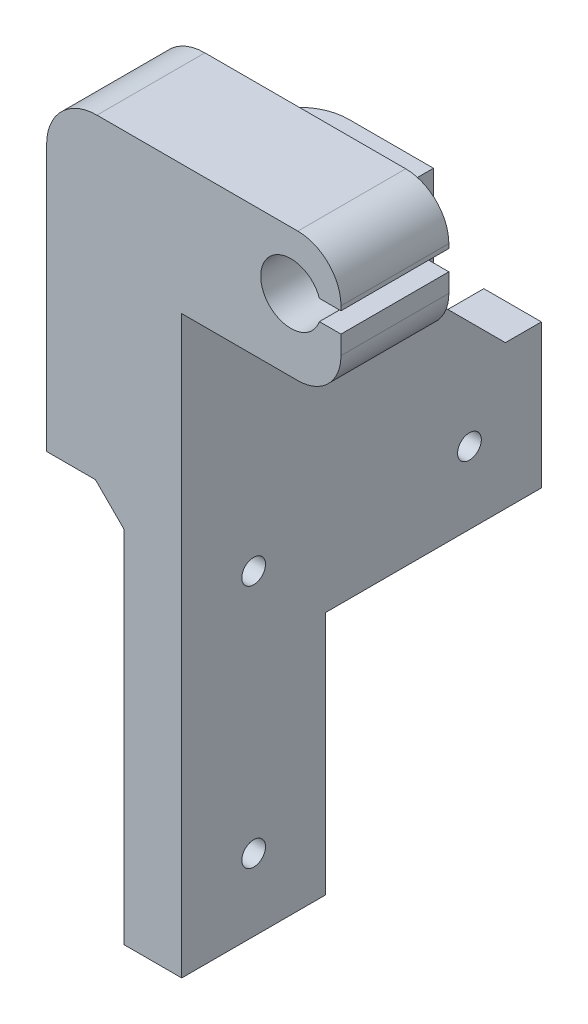
ISO-10303-21;
HEADER;
FILE_DESCRIPTION(('STEP AP214'),'2;1');
FILE_NAME('part.step','',(''),(''),'','','');
FILE_SCHEMA(('AUTOMOTIVE_DESIGN { 1 0 10303 214 1 1 1 1 }'));
ENDSEC;
DATA;
#1=APPLICATION_CONTEXT('core data for automotive mechanical design processes');
#2=APPLICATION_PROTOCOL_DEFINITION('international standard','automotive_design',2000,#1);
#3=PRODUCT_CONTEXT('',#1,'mechanical');
#4=PRODUCT('Part','Part','',(#3));
#5=PRODUCT_RELATED_PRODUCT_CATEGORY('part','',(#4));
#6=PRODUCT_DEFINITION_FORMATION('','',#4);
#7=PRODUCT_DEFINITION_CONTEXT('part definition',#1,'design');
#8=PRODUCT_DEFINITION('design','',#6,#7);
#9=PRODUCT_DEFINITION_SHAPE('','',#8);
#10=(LENGTH_UNIT() NAMED_UNIT(*) SI_UNIT(.MILLI.,.METRE.));
#11=(NAMED_UNIT(*) PLANE_ANGLE_UNIT() SI_UNIT($,.RADIAN.));
#12=(NAMED_UNIT(*) SI_UNIT($,.STERADIAN.) SOLID_ANGLE_UNIT());
#13=UNCERTAINTY_MEASURE_WITH_UNIT(LENGTH_MEASURE(1.E-05),#10,'distance_accuracy_value','');
#14=(GEOMETRIC_REPRESENTATION_CONTEXT(3) GLOBAL_UNCERTAINTY_ASSIGNED_CONTEXT((#13)) GLOBAL_UNIT_ASSIGNED_CONTEXT((#10,
#11,#12)) REPRESENTATION_CONTEXT('',''));
#15=CARTESIAN_POINT('',(0.,0.,0.));
#16=DIRECTION('',(0.,0.,1.));
#17=DIRECTION('',(1.,0.,0.));
#18=AXIS2_PLACEMENT_3D('',#15,#16,#17);
#19=CARTESIAN_POINT('',(0.,0.,15.));
#20=DIRECTION('',(1.,0.,0.));
#21=DIRECTION('',(0.,1.,0.));
#22=AXIS2_PLACEMENT_3D('',#19,#20,#21);
#23=PLANE('',#22);
#24=CARTESIAN_POINT('',(0.,-10.,-25.));
#25=DIRECTION('',(-1.,0.,0.));
#26=DIRECTION('',(0.,-1.,0.));
#27=AXIS2_PLACEMENT_3D('',#24,#25,#26);
#28=CIRCLE('',#27,1.65);
#29=CARTESIAN_POINT('',(0.,-11.65,-25.));
#30=VERTEX_POINT('',#29);
#31=EDGE_CURVE('E371',#30,#30,#28,.T.);
#32=ORIENTED_EDGE('',*,*,#31,.F.);
#33=EDGE_LOOP('',(#32));
#34=FACE_BOUND('',#33,.T.);
#35=DIRECTION('',(0.,0.,1.));
#36=VECTOR('',#35,1.);
#37=CARTESIAN_POINT('',(0.,-20.,-35.));
#38=LINE('',#37,#36);
#39=CARTESIAN_POINT('',(0.,-20.,-35.));
#40=VERTEX_POINT('',#39);
#41=CARTESIAN_POINT('',(0.,-20.,-11.0851811435686));
#42=VERTEX_POINT('',#41);
#43=EDGE_CURVE('E235',#40,#42,#38,.T.);
#44=ORIENTED_EDGE('',*,*,#43,.T.);
#45=DIRECTION('',(0.,1.,0.));
#46=VECTOR('',#45,1.);
#47=CARTESIAN_POINT('',(0.,-67.,-11.0851811435686));
#48=LINE('',#47,#46);
#49=CARTESIAN_POINT('',(0.,0.,-11.0851811435686));
#50=VERTEX_POINT('',#49);
#51=EDGE_CURVE('E213',#42,#50,#48,.T.);
#52=ORIENTED_EDGE('',*,*,#51,.T.);
#53=DIRECTION('',(0.,0.,1.));
#54=VECTOR('',#53,1.);
#55=CARTESIAN_POINT('',(0.,0.,-35.));
#56=LINE('',#55,#54);
#57=CARTESIAN_POINT('',(0.,0.,-20.));
#58=VERTEX_POINT('',#57);
#59=EDGE_CURVE('E240',#58,#50,#56,.T.);
#60=ORIENTED_EDGE('',*,*,#59,.F.);
#61=DIRECTION('',(0.,-1.,0.));
#62=VECTOR('',#61,1.);
#63=CARTESIAN_POINT('',(0.,0.,-20.));
#64=LINE('',#63,#62);
#65=CARTESIAN_POINT('',(0.,10.0000000000001,-20.));
#66=VERTEX_POINT('',#65);
#67=EDGE_CURVE('E367',#66,#58,#64,.T.);
#68=ORIENTED_EDGE('',*,*,#67,.F.);
#69=DIRECTION('',(0.,0.707106781186551,0.707106781186544));
#70=VECTOR('',#69,1.);
#71=CARTESIAN_POINT('',(0.,22.5,-7.50000000000021));
#72=LINE('',#71,#70);
#73=CARTESIAN_POINT('',(0.,0.,-30.));
#74=VERTEX_POINT('',#73);
#75=EDGE_CURVE('E386',#66,#74,#72,.F.);
#76=ORIENTED_EDGE('',*,*,#75,.T.);
#77=CARTESIAN_POINT('',(0.,0.,-35.));
#78=VERTEX_POINT('',#77);
#79=EDGE_CURVE('E236',#78,#74,#56,.T.);
#80=ORIENTED_EDGE('',*,*,#79,.F.);
#81=DIRECTION('',(0.,1.,0.));
#82=VECTOR('',#81,1.);
#83=CARTESIAN_POINT('',(0.,0.,-35.));
#84=LINE('',#83,#82);
#85=EDGE_CURVE('E457',#40,#78,#84,.T.);
#86=ORIENTED_EDGE('',*,*,#85,.F.);
#87=EDGE_LOOP('',(#44,#52,#60,#68,#76,#80,#86));
#88=FACE_BOUND('',#87,.T.);
#89=ADVANCED_FACE('F34',(#34,#88),#23,.F.);
#90=CARTESIAN_POINT('',(-10.78,0.,15.));
#91=DIRECTION('',(0.,1.,0.));
#92=DIRECTION('',(0.,0.,1.));
#93=AXIS2_PLACEMENT_3D('',#90,#91,#92);
#94=PLANE('',#93);
#95=ORIENTED_EDGE('',*,*,#59,.T.);
#96=CARTESIAN_POINT('',(1.22,0.,-10.05));
#97=DIRECTION('',(0.,1.,0.));
#98=DIRECTION('',(0.,0.,1.));
#99=AXIS2_PLACEMENT_3D('',#96,#97,#98);
#100=CIRCLE('',#99,1.6);
#101=CARTESIAN_POINT('',(0.,0.,-9.01481885643139));
#102=VERTEX_POINT('',#101);
#103=EDGE_CURVE('E469',#50,#102,#100,.T.);
#104=ORIENTED_EDGE('',*,*,#103,.T.);
#105=CARTESIAN_POINT('',(0.,0.,-5.));
#106=VERTEX_POINT('',#105);
#107=EDGE_CURVE('E228',#102,#106,#56,.T.);
#108=ORIENTED_EDGE('',*,*,#107,.T.);
#109=DIRECTION('',(1.,0.,0.));
#110=VECTOR('',#109,1.);
#111=CARTESIAN_POINT('',(8.,0.,-5.));
#112=LINE('',#111,#110);
#113=CARTESIAN_POINT('',(-3.99999999999999,0.,-5.));
#114=VERTEX_POINT('',#113);
#115=EDGE_CURVE('E260',#114,#106,#112,.T.);
#116=ORIENTED_EDGE('',*,*,#115,.F.);
#117=DIRECTION('',(0.,0.,1.));
#118=VECTOR('',#117,1.);
#119=CARTESIAN_POINT('',(-3.99999999999999,0.,15.));
#120=LINE('',#119,#118);
#121=CARTESIAN_POINT('',(-3.99999999999999,0.,15.));
#122=VERTEX_POINT('',#121);
#123=EDGE_CURVE('E286',#114,#122,#120,.T.);
#124=ORIENTED_EDGE('',*,*,#123,.T.);
#125=DIRECTION('',(1.,0.,0.));
#126=VECTOR('',#125,1.);
#127=CARTESIAN_POINT('',(-10.78,0.,15.));
#128=LINE('',#127,#126);
#129=CARTESIAN_POINT('',(-10.78,0.,15.));
#130=VERTEX_POINT('',#129);
#131=EDGE_CURVE('E309',#130,#122,#128,.T.);
#132=ORIENTED_EDGE('',*,*,#131,.F.);
#133=DIRECTION('',(0.,0.,-1.));
#134=VECTOR('',#133,1.);
#135=CARTESIAN_POINT('',(-10.78,0.,15.));
#136=LINE('',#135,#134);
#137=CARTESIAN_POINT('',(-10.78,0.,-13.));
#138=VERTEX_POINT('',#137);
#139=EDGE_CURVE('E305',#130,#138,#136,.T.);
#140=ORIENTED_EDGE('',*,*,#139,.T.);
#141=CARTESIAN_POINT('',(-3.78,0.,-13.));
#142=DIRECTION('',(0.,1.,0.));
#143=DIRECTION('',(0.,0.,1.));
#144=AXIS2_PLACEMENT_3D('',#141,#142,#143);
#145=CIRCLE('',#144,7.);
#146=CARTESIAN_POINT('',(-3.78,0.,-20.));
#147=VERTEX_POINT('',#146);
#148=EDGE_CURVE('E361',#138,#147,#145,.F.);
#149=ORIENTED_EDGE('',*,*,#148,.T.);
#150=DIRECTION('',(-1.,0.,0.));
#151=VECTOR('',#150,1.);
#152=CARTESIAN_POINT('',(-10.78,0.,-20.));
#153=LINE('',#152,#151);
#154=EDGE_CURVE('E267',#58,#147,#153,.T.);
#155=ORIENTED_EDGE('',*,*,#154,.F.);
#156=EDGE_LOOP('',(#95,#104,#108,#116,#124,#132,#140,#149,#155));
#157=FACE_BOUND('',#156,.T.);
#158=ADVANCED_FACE('F419',(#157),#94,.F.);
#159=CARTESIAN_POINT('',(0.,0.,-5.));
#160=DIRECTION('',(0.,0.,-1.));
#161=DIRECTION('',(-1.,0.,0.));
#162=AXIS2_PLACEMENT_3D('',#159,#160,#161);
#163=PLANE('',#162);
#164=DIRECTION('',(0.,1.,0.));
#165=VECTOR('',#164,1.);
#166=CARTESIAN_POINT('',(0.,0.,-5.));
#167=LINE('',#166,#165);
#168=CARTESIAN_POINT('',(0.,-54.,-5.));
#169=VERTEX_POINT('',#168);
#170=CARTESIAN_POINT('',(0.,-20.,-5.));
#171=VERTEX_POINT('',#170);
#172=EDGE_CURVE('E258',#169,#171,#167,.T.);
#173=ORIENTED_EDGE('',*,*,#172,.T.);
#174=DIRECTION('',(-1.,0.,0.));
#175=VECTOR('',#174,1.);
#176=CARTESIAN_POINT('',(8.,-20.,-5.));
#177=LINE('',#176,#175);
#178=CARTESIAN_POINT('',(8.,-20.,-5.));
#179=VERTEX_POINT('',#178);
#180=EDGE_CURVE('E234',#179,#171,#177,.T.);
#181=ORIENTED_EDGE('',*,*,#180,.F.);
#182=DIRECTION('',(0.,-1.,0.));
#183=VECTOR('',#182,1.);
#184=CARTESIAN_POINT('',(8.,0.,-5.));
#185=LINE('',#184,#183);
#186=CARTESIAN_POINT('',(8.,-54.,-5.));
#187=VERTEX_POINT('',#186);
#188=EDGE_CURVE('E253',#179,#187,#185,.T.);
#189=ORIENTED_EDGE('',*,*,#188,.T.);
#190=DIRECTION('',(-1.,0.,0.));
#191=VECTOR('',#190,1.);
#192=CARTESIAN_POINT('',(8.,-54.,-5.));
#193=LINE('',#192,#191);
#194=EDGE_CURVE('E255',#187,#169,#193,.T.);
#195=ORIENTED_EDGE('',*,*,#194,.T.);
#196=EDGE_LOOP('',(#173,#181,#189,#195));
#197=FACE_BOUND('',#196,.T.);
#198=ADVANCED_FACE('F323',(#197),#163,.T.);
#199=ORIENTED_EDGE('',*,*,#115,.T.);
#200=DIRECTION('',(0.,-1.,0.));
#201=VECTOR('',#200,1.);
#202=CARTESIAN_POINT('',(0.,0.,-5.));
#203=LINE('',#202,#201);
#204=CARTESIAN_POINT('',(0.,-4.00000000000002,-5.));
#205=VERTEX_POINT('',#204);
#206=EDGE_CURVE('E364',#106,#205,#203,.T.);
#207=ORIENTED_EDGE('',*,*,#206,.T.);
#208=DIRECTION('',(0.707106781186545,-0.70710678118655,0.));
#209=VECTOR('',#208,1.);
#210=CARTESIAN_POINT('',(0.,-4.00000000000002,-5.));
#211=LINE('',#210,#209);
#212=EDGE_CURVE('E288',#205,#114,#211,.F.);
#213=ORIENTED_EDGE('',*,*,#212,.T.);
#214=EDGE_LOOP('',(#199,#207,#213));
#215=FACE_BOUND('',#214,.T.);
#216=ADVANCED_FACE('F438',(#215),#163,.T.);
#217=CARTESIAN_POINT('',(0.,0.,0.));
#218=DIRECTION('',(0.,0.,-1.));
#219=DIRECTION('',(-1.,0.,0.));
#220=AXIS2_PLACEMENT_3D('',#217,#218,#219);
#221=PLANE('',#220);
#222=DIRECTION('',(0.,1.,0.));
#223=VECTOR('',#222,1.);
#224=CARTESIAN_POINT('',(30.14,34.6005715452371,0.));
#225=LINE('',#224,#223);
#226=CARTESIAN_POINT('',(30.14,32.,0.));
#227=VERTEX_POINT('',#226);
#228=CARTESIAN_POINT('',(30.14,34.6005715452371,0.));
#229=VERTEX_POINT('',#228);
#230=EDGE_CURVE('E477',#227,#229,#225,.T.);
#231=ORIENTED_EDGE('',*,*,#230,.F.);
#232=CARTESIAN_POINT('',(24.14,32.,0.));
#233=DIRECTION('',(0.,0.,-1.));
#234=DIRECTION('',(-1.,0.,0.));
#235=AXIS2_PLACEMENT_3D('',#232,#233,#234);
#236=CIRCLE('',#235,6.);
#237=CARTESIAN_POINT('',(24.14,26.,0.));
#238=VERTEX_POINT('',#237);
#239=EDGE_CURVE('E11',#227,#238,#236,.T.);
#240=ORIENTED_EDGE('',*,*,#239,.T.);
#241=DIRECTION('',(1.,0.,0.));
#242=VECTOR('',#241,1.);
#243=CARTESIAN_POINT('',(8.,26.,0.));
#244=LINE('',#243,#242);
#245=CARTESIAN_POINT('',(8.,26.,0.));
#246=VERTEX_POINT('',#245);
#247=EDGE_CURVE('E343',#246,#238,#244,.T.);
#248=ORIENTED_EDGE('',*,*,#247,.F.);
#249=DIRECTION('',(1.,0.,0.));
#250=VECTOR('',#249,1.);
#251=CARTESIAN_POINT('',(8.,26.,0.));
#252=LINE('',#251,#250);
#253=CARTESIAN_POINT('',(-10.78,26.,0.));
#254=VERTEX_POINT('',#253);
#255=EDGE_CURVE('E263',#254,#246,#252,.T.);
#256=ORIENTED_EDGE('',*,*,#255,.F.);
#257=DIRECTION('',(0.,-1.,0.));
#258=VECTOR('',#257,1.);
#259=CARTESIAN_POINT('',(-10.78,44.,0.));
#260=LINE('',#259,#258);
#261=CARTESIAN_POINT('',(-10.78,37.,0.));
#262=VERTEX_POINT('',#261);
#263=EDGE_CURVE('E294',#262,#254,#260,.T.);
#264=ORIENTED_EDGE('',*,*,#263,.F.);
#265=CARTESIAN_POINT('',(-3.78,37.,0.));
#266=DIRECTION('',(0.,0.,-1.));
#267=DIRECTION('',(-1.,0.,0.));
#268=AXIS2_PLACEMENT_3D('',#265,#266,#267);
#269=CIRCLE('',#268,7.);
#270=CARTESIAN_POINT('',(-3.78,44.,0.));
#271=VERTEX_POINT('',#270);
#272=EDGE_CURVE('E829',#262,#271,#269,.T.);
#273=ORIENTED_EDGE('',*,*,#272,.T.);
#274=DIRECTION('',(-1.,0.,0.));
#275=VECTOR('',#274,1.);
#276=CARTESIAN_POINT('',(27.14,44.,0.));
#277=LINE('',#276,#275);
#278=CARTESIAN_POINT('',(24.14,44.,0.));
#279=VERTEX_POINT('',#278);
#280=EDGE_CURVE('E299',#279,#271,#277,.T.);
#281=ORIENTED_EDGE('',*,*,#280,.F.);
#282=CARTESIAN_POINT('',(24.14,38.,0.));
#283=DIRECTION('',(0.,0.,-1.));
#284=DIRECTION('',(-1.,0.,0.));
#285=AXIS2_PLACEMENT_3D('',#282,#283,#284);
#286=CIRCLE('',#285,6.);
#287=CARTESIAN_POINT('',(30.14,38.,0.));
#288=VERTEX_POINT('',#287);
#289=EDGE_CURVE('E219',#279,#288,#286,.T.);
#290=ORIENTED_EDGE('',*,*,#289,.T.);
#291=DIRECTION('',(0.,1.,0.));
#292=VECTOR('',#291,1.);
#293=CARTESIAN_POINT('',(30.14,37.3994284547629,0.));
#294=LINE('',#293,#292);
#295=CARTESIAN_POINT('',(30.14,37.3994284547629,0.));
#296=VERTEX_POINT('',#295);
#297=EDGE_CURVE('E493',#296,#288,#294,.T.);
#298=ORIENTED_EDGE('',*,*,#297,.F.);
#299=DIRECTION('',(1.,0.,0.));
#300=VECTOR('',#299,1.);
#301=CARTESIAN_POINT('',(27.14,37.3994284547629,0.));
#302=LINE('',#301,#300);
#303=CARTESIAN_POINT('',(27.14,37.3994284547629,0.));
#304=VERTEX_POINT('',#303);
#305=EDGE_CURVE('E490',#304,#296,#302,.T.);
#306=ORIENTED_EDGE('',*,*,#305,.F.);
#307=CARTESIAN_POINT('',(23.18,36.,0.));
#308=DIRECTION('',(0.,0.,-1.));
#309=DIRECTION('',(-1.,0.,0.));
#310=AXIS2_PLACEMENT_3D('',#307,#308,#309);
#311=CIRCLE('',#310,4.2);
#312=CARTESIAN_POINT('',(27.14,34.6005715452371,0.));
#313=VERTEX_POINT('',#312);
#314=EDGE_CURVE('E245',#313,#304,#311,.T.);
#315=ORIENTED_EDGE('',*,*,#314,.F.);
#316=DIRECTION('',(-1.,0.,0.));
#317=VECTOR('',#316,1.);
#318=CARTESIAN_POINT('',(27.14,34.6005715452371,0.));
#319=LINE('',#318,#317);
#320=EDGE_CURVE('E479',#229,#313,#319,.T.);
#321=ORIENTED_EDGE('',*,*,#320,.F.);
#322=EDGE_LOOP('',(#231,#240,#248,#256,#264,#273,#281,#290,#298,#306,#315,#321));
#323=FACE_BOUND('',#322,.T.);
#324=ADVANCED_FACE('F432',(#323),#221,.T.);
#325=CARTESIAN_POINT('',(0.,-44.,5.));
#326=DIRECTION('',(-1.,0.,0.));
#327=DIRECTION('',(0.,-1.,0.));
#328=AXIS2_PLACEMENT_3D('',#325,#326,#327);
#329=CIRCLE('',#328,1.65);
#330=CARTESIAN_POINT('',(0.,-45.65,5.));
#331=VERTEX_POINT('',#330);
#332=EDGE_CURVE('E379',#331,#331,#329,.T.);
#333=ORIENTED_EDGE('',*,*,#332,.F.);
#334=EDGE_LOOP('',(#333));
#335=FACE_BOUND('',#334,.T.);
#336=CARTESIAN_POINT('',(0.,-10.,5.));
#337=DIRECTION('',(-1.,0.,0.));
#338=DIRECTION('',(0.,-1.,0.));
#339=AXIS2_PLACEMENT_3D('',#336,#337,#338);
#340=CIRCLE('',#339,1.65);
#341=CARTESIAN_POINT('',(0.,-11.65,5.));
#342=VERTEX_POINT('',#341);
#343=EDGE_CURVE('E375',#342,#342,#340,.T.);
#344=ORIENTED_EDGE('',*,*,#343,.F.);
#345=EDGE_LOOP('',(#344));
#346=FACE_BOUND('',#345,.T.);
#347=ORIENTED_EDGE('',*,*,#107,.F.);
#348=DIRECTION('',(0.,1.,0.));
#349=VECTOR('',#348,1.);
#350=CARTESIAN_POINT('',(0.,-67.,-9.01481885643139));
#351=LINE('',#350,#349);
#352=CARTESIAN_POINT('',(0.,-20.,-9.01481885643139));
#353=VERTEX_POINT('',#352);
#354=EDGE_CURVE('E210',#102,#353,#351,.F.);
#355=ORIENTED_EDGE('',*,*,#354,.T.);
#356=EDGE_CURVE('E225',#353,#171,#38,.T.);
#357=ORIENTED_EDGE('',*,*,#356,.T.);
#358=ORIENTED_EDGE('',*,*,#172,.F.);
#359=DIRECTION('',(0.,0.,-1.));
#360=VECTOR('',#359,1.);
#361=CARTESIAN_POINT('',(0.,-54.,15.));
#362=LINE('',#361,#360);
#363=CARTESIAN_POINT('',(0.,-54.,15.));
#364=VERTEX_POINT('',#363);
#365=EDGE_CURVE('E284',#364,#169,#362,.T.);
#366=ORIENTED_EDGE('',*,*,#365,.F.);
#367=DIRECTION('',(0.,-1.,0.));
#368=VECTOR('',#367,1.);
#369=CARTESIAN_POINT('',(0.,0.,15.));
#370=LINE('',#369,#368);
#371=CARTESIAN_POINT('',(0.,-4.00000000000002,15.));
#372=VERTEX_POINT('',#371);
#373=EDGE_CURVE('E298',#372,#364,#370,.T.);
#374=ORIENTED_EDGE('',*,*,#373,.F.);
#375=DIRECTION('',(0.,0.,-1.));
#376=VECTOR('',#375,1.);
#377=CARTESIAN_POINT('',(0.,-4.00000000000002,-5.));
#378=LINE('',#377,#376);
#379=EDGE_CURVE('E283',#372,#205,#378,.T.);
#380=ORIENTED_EDGE('',*,*,#379,.T.);
#381=ORIENTED_EDGE('',*,*,#206,.F.);
#382=EDGE_LOOP('',(#347,#355,#357,#358,#366,#374,#380,#381));
#383=FACE_BOUND('',#382,.T.);
#384=ADVANCED_FACE('F223',(#335,#346,#383),#23,.F.);
#385=CARTESIAN_POINT('',(8.,-54.,15.));
#386=DIRECTION('',(0.,1.,0.));
#387=DIRECTION('',(0.,0.,1.));
#388=AXIS2_PLACEMENT_3D('',#385,#386,#387);
#389=PLANE('',#388);
#390=ORIENTED_EDGE('',*,*,#365,.T.);
#391=ORIENTED_EDGE('',*,*,#194,.F.);
#392=DIRECTION('',(0.,0.,-1.));
#393=VECTOR('',#392,1.);
#394=CARTESIAN_POINT('',(8.,-54.,15.));
#395=LINE('',#394,#393);
#396=CARTESIAN_POINT('',(8.,-54.,15.));
#397=VERTEX_POINT('',#396);
#398=EDGE_CURVE('E312',#397,#187,#395,.T.);
#399=ORIENTED_EDGE('',*,*,#398,.F.);
#400=DIRECTION('',(1.,0.,0.));
#401=VECTOR('',#400,1.);
#402=CARTESIAN_POINT('',(8.,-54.,15.));
#403=LINE('',#402,#401);
#404=EDGE_CURVE('E320',#364,#397,#403,.T.);
#405=ORIENTED_EDGE('',*,*,#404,.F.);
#406=EDGE_LOOP('',(#390,#391,#399,#405));
#407=FACE_BOUND('',#406,.T.);
#408=ADVANCED_FACE('F318',(#407),#389,.F.);
#409=CARTESIAN_POINT('',(8.,-54.,15.));
#410=DIRECTION('',(-1.,0.,0.));
#411=DIRECTION('',(0.,0.,1.));
#412=AXIS2_PLACEMENT_3D('',#409,#410,#411);
#413=PLANE('',#412);
#414=CARTESIAN_POINT('',(8.,-44.,5.));
#415=DIRECTION('',(-1.,0.,0.));
#416=DIRECTION('',(0.,0.,1.));
#417=AXIS2_PLACEMENT_3D('',#414,#415,#416);
#418=CIRCLE('',#417,1.65);
#419=CARTESIAN_POINT('',(8.,-44.,6.65));
#420=VERTEX_POINT('',#419);
#421=EDGE_CURVE('E376',#420,#420,#418,.T.);
#422=ORIENTED_EDGE('',*,*,#421,.T.);
#423=EDGE_LOOP('',(#422));
#424=FACE_BOUND('',#423,.T.);
#425=CARTESIAN_POINT('',(8.,-10.,5.));
#426=DIRECTION('',(-1.,0.,0.));
#427=DIRECTION('',(0.,0.,1.));
#428=AXIS2_PLACEMENT_3D('',#425,#426,#427);
#429=CIRCLE('',#428,1.65);
#430=CARTESIAN_POINT('',(8.,-10.,6.65));
#431=VERTEX_POINT('',#430);
#432=EDGE_CURVE('E372',#431,#431,#429,.T.);
#433=ORIENTED_EDGE('',*,*,#432,.T.);
#434=EDGE_LOOP('',(#433));
#435=FACE_BOUND('',#434,.T.);
#436=CARTESIAN_POINT('',(8.,-10.,-25.));
#437=DIRECTION('',(-1.,0.,0.));
#438=DIRECTION('',(0.,0.,1.));
#439=AXIS2_PLACEMENT_3D('',#436,#437,#438);
#440=CIRCLE('',#439,1.65);
#441=CARTESIAN_POINT('',(8.,-10.,-23.35));
#442=VERTEX_POINT('',#441);
#443=EDGE_CURVE('E368',#442,#442,#440,.T.);
#444=ORIENTED_EDGE('',*,*,#443,.T.);
#445=EDGE_LOOP('',(#444));
#446=FACE_BOUND('',#445,.T.);
#447=ORIENTED_EDGE('',*,*,#398,.T.);
#448=ORIENTED_EDGE('',*,*,#188,.F.);
#449=DIRECTION('',(0.,0.,1.));
#450=VECTOR('',#449,1.);
#451=CARTESIAN_POINT('',(8.,-20.,-35.));
#452=LINE('',#451,#450);
#453=CARTESIAN_POINT('',(8.,-20.,-35.));
#454=VERTEX_POINT('',#453);
#455=EDGE_CURVE('E238',#454,#179,#452,.T.);
#456=ORIENTED_EDGE('',*,*,#455,.F.);
#457=DIRECTION('',(0.,-1.,0.));
#458=VECTOR('',#457,1.);
#459=CARTESIAN_POINT('',(8.,0.,-35.));
#460=LINE('',#459,#458);
#461=CARTESIAN_POINT('',(8.,0.,-35.));
#462=VERTEX_POINT('',#461);
#463=EDGE_CURVE('E452',#462,#454,#460,.T.);
#464=ORIENTED_EDGE('',*,*,#463,.F.);
#465=DIRECTION('',(0.,0.,1.));
#466=VECTOR('',#465,1.);
#467=CARTESIAN_POINT('',(8.,0.,-35.));
#468=LINE('',#467,#466);
#469=CARTESIAN_POINT('',(8.,0.,-30.));
#470=VERTEX_POINT('',#469);
#471=EDGE_CURVE('E461',#462,#470,#468,.T.);
#472=ORIENTED_EDGE('',*,*,#471,.T.);
#473=DIRECTION('',(0.,-0.707106781186551,-0.707106781186544));
#474=VECTOR('',#473,1.);
#475=CARTESIAN_POINT('',(8.,-4.50000000000027,-34.5000000000002));
#476=LINE('',#475,#474);
#477=CARTESIAN_POINT('',(8.,10.0000000000001,-20.));
#478=VERTEX_POINT('',#477);
#479=EDGE_CURVE('E388',#470,#478,#476,.F.);
#480=ORIENTED_EDGE('',*,*,#479,.T.);
#481=DIRECTION('',(0.,-1.,0.));
#482=VECTOR('',#481,1.);
#483=CARTESIAN_POINT('',(8.,0.,-20.));
#484=LINE('',#483,#482);
#485=CARTESIAN_POINT('',(8.,26.,-20.));
#486=VERTEX_POINT('',#485);
#487=EDGE_CURVE('E264',#486,#478,#484,.T.);
#488=ORIENTED_EDGE('',*,*,#487,.F.);
#489=DIRECTION('',(0.,0.,1.));
#490=VECTOR('',#489,1.);
#491=CARTESIAN_POINT('',(8.,26.,-20.));
#492=LINE('',#491,#490);
#493=EDGE_CURVE('E271',#486,#246,#492,.T.);
#494=ORIENTED_EDGE('',*,*,#493,.T.);
#495=DIRECTION('',(0.,0.,-1.));
#496=VECTOR('',#495,1.);
#497=CARTESIAN_POINT('',(8.,26.,15.));
#498=LINE('',#497,#496);
#499=CARTESIAN_POINT('',(8.,26.,15.));
#500=VERTEX_POINT('',#499);
#501=EDGE_CURVE('E308',#500,#246,#498,.T.);
#502=ORIENTED_EDGE('',*,*,#501,.F.);
#503=DIRECTION('',(0.,1.,0.));
#504=VECTOR('',#503,1.);
#505=CARTESIAN_POINT('',(8.,-54.,15.));
#506=LINE('',#505,#504);
#507=EDGE_CURVE('E330',#397,#500,#506,.T.);
#508=ORIENTED_EDGE('',*,*,#507,.F.);
#509=EDGE_LOOP('',(#447,#448,#456,#464,#472,#480,#488,#494,#502,#508));
#510=FACE_BOUND('',#509,.T.);
#511=ADVANCED_FACE('F328',(#424,#435,#446,#510),#413,.F.);
#512=CARTESIAN_POINT('',(8.,26.,15.));
#513=DIRECTION('',(0.,1.,0.));
#514=DIRECTION('',(0.,0.,1.));
#515=AXIS2_PLACEMENT_3D('',#512,#513,#514);
#516=PLANE('',#515);
#517=ORIENTED_EDGE('',*,*,#247,.T.);
#518=DIRECTION('',(0.,0.,1.));
#519=VECTOR('',#518,1.);
#520=CARTESIAN_POINT('',(24.14,26.,15.));
#521=LINE('',#520,#519);
#522=CARTESIAN_POINT('',(24.14,26.,15.));
#523=VERTEX_POINT('',#522);
#524=EDGE_CURVE('E218',#238,#523,#521,.T.);
#525=ORIENTED_EDGE('',*,*,#524,.T.);
#526=DIRECTION('',(1.,0.,0.));
#527=VECTOR('',#526,1.);
#528=CARTESIAN_POINT('',(8.,26.,15.));
#529=LINE('',#528,#527);
#530=EDGE_CURVE('E333',#500,#523,#529,.T.);
#531=ORIENTED_EDGE('',*,*,#530,.F.);
#532=ORIENTED_EDGE('',*,*,#501,.T.);
#533=EDGE_LOOP('',(#517,#525,#531,#532));
#534=FACE_BOUND('',#533,.T.);
#535=ADVANCED_FACE('F399',(#534),#516,.F.);
#536=CARTESIAN_POINT('',(27.14,44.,15.));
#537=DIRECTION('',(0.,-1.,0.));
#538=DIRECTION('',(1.,0.,0.));
#539=AXIS2_PLACEMENT_3D('',#536,#537,#538);
#540=PLANE('',#539);
#541=DIRECTION('',(-1.,0.,0.));
#542=VECTOR('',#541,1.);
#543=CARTESIAN_POINT('',(27.14,44.,15.));
#544=LINE('',#543,#542);
#545=CARTESIAN_POINT('',(24.14,44.,15.));
#546=VERTEX_POINT('',#545);
#547=CARTESIAN_POINT('',(-3.78,44.,15.));
#548=VERTEX_POINT('',#547);
#549=EDGE_CURVE('E335',#546,#548,#544,.T.);
#550=ORIENTED_EDGE('',*,*,#549,.F.);
#551=DIRECTION('',(0.,0.,1.));
#552=VECTOR('',#551,1.);
#553=CARTESIAN_POINT('',(24.14,44.,0.));
#554=LINE('',#553,#552);
#555=EDGE_CURVE('E395',#546,#279,#554,.F.);
#556=ORIENTED_EDGE('',*,*,#555,.T.);
#557=ORIENTED_EDGE('',*,*,#280,.T.);
#558=DIRECTION('',(0.,0.,-1.));
#559=VECTOR('',#558,1.);
#560=CARTESIAN_POINT('',(-3.78,44.,15.));
#561=LINE('',#560,#559);
#562=EDGE_CURVE('E820',#271,#548,#561,.F.);
#563=ORIENTED_EDGE('',*,*,#562,.T.);
#564=EDGE_LOOP('',(#550,#556,#557,#563));
#565=FACE_BOUND('',#564,.T.);
#566=ADVANCED_FACE('F414',(#565),#540,.F.);
#567=CARTESIAN_POINT('',(-10.78,44.,15.));
#568=DIRECTION('',(1.,0.,0.));
#569=DIRECTION('',(0.,0.,-1.));
#570=AXIS2_PLACEMENT_3D('',#567,#568,#569);
#571=PLANE('',#570);
#572=DIRECTION('',(0.,0.,1.));
#573=VECTOR('',#572,1.);
#574=CARTESIAN_POINT('',(-10.78,26.,-20.));
#575=LINE('',#574,#573);
#576=CARTESIAN_POINT('',(-10.78,26.,-13.));
#577=VERTEX_POINT('',#576);
#578=EDGE_CURVE('E345',#577,#254,#575,.T.);
#579=ORIENTED_EDGE('',*,*,#578,.F.);
#580=DIRECTION('',(0.,1.,0.));
#581=VECTOR('',#580,1.);
#582=CARTESIAN_POINT('',(-10.78,44.,-13.));
#583=LINE('',#582,#581);
#584=EDGE_CURVE('E359',#577,#138,#583,.F.);
#585=ORIENTED_EDGE('',*,*,#584,.T.);
#586=ORIENTED_EDGE('',*,*,#139,.F.);
#587=DIRECTION('',(0.,-1.,0.));
#588=VECTOR('',#587,1.);
#589=CARTESIAN_POINT('',(-10.78,44.,15.));
#590=LINE('',#589,#588);
#591=CARTESIAN_POINT('',(-10.78,37.,15.));
#592=VERTEX_POINT('',#591);
#593=EDGE_CURVE('E340',#592,#130,#590,.T.);
#594=ORIENTED_EDGE('',*,*,#593,.F.);
#595=DIRECTION('',(0.,0.,-1.));
#596=VECTOR('',#595,1.);
#597=CARTESIAN_POINT('',(-10.78,37.,15.));
#598=LINE('',#597,#596);
#599=EDGE_CURVE('E293',#592,#262,#598,.T.);
#600=ORIENTED_EDGE('',*,*,#599,.T.);
#601=ORIENTED_EDGE('',*,*,#263,.T.);
#602=EDGE_LOOP('',(#579,#585,#586,#594,#600,#601));
#603=FACE_BOUND('',#602,.T.);
#604=ADVANCED_FACE('F405',(#603),#571,.F.);
#605=CARTESIAN_POINT('',(0.,0.,15.));
#606=DIRECTION('',(0.,0.,-1.));
#607=DIRECTION('',(-1.,0.,0.));
#608=AXIS2_PLACEMENT_3D('',#605,#606,#607);
#609=PLANE('',#608);
#610=ORIENTED_EDGE('',*,*,#530,.T.);
#611=CARTESIAN_POINT('',(24.14,32.,15.));
#612=DIRECTION('',(0.,0.,-1.));
#613=DIRECTION('',(-1.,0.,0.));
#614=AXIS2_PLACEMENT_3D('',#611,#612,#613);
#615=CIRCLE('',#614,6.);
#616=CARTESIAN_POINT('',(30.14,32.,15.));
#617=VERTEX_POINT('',#616);
#618=EDGE_CURVE('E56',#523,#617,#615,.F.);
#619=ORIENTED_EDGE('',*,*,#618,.T.);
#620=DIRECTION('',(0.,1.,0.));
#621=VECTOR('',#620,1.);
#622=CARTESIAN_POINT('',(30.14,34.6005715452371,15.));
#623=LINE('',#622,#621);
#624=CARTESIAN_POINT('',(30.14,34.6005715452371,15.));
#625=VERTEX_POINT('',#624);
#626=EDGE_CURVE('E473',#617,#625,#623,.T.);
#627=ORIENTED_EDGE('',*,*,#626,.T.);
#628=DIRECTION('',(-1.,0.,0.));
#629=VECTOR('',#628,1.);
#630=CARTESIAN_POINT('',(27.14,34.6005715452371,15.));
#631=LINE('',#630,#629);
#632=CARTESIAN_POINT('',(27.14,34.6005715452371,15.));
#633=VERTEX_POINT('',#632);
#634=EDGE_CURVE('E480',#625,#633,#631,.T.);
#635=ORIENTED_EDGE('',*,*,#634,.T.);
#636=CARTESIAN_POINT('',(23.18,36.,15.));
#637=DIRECTION('',(0.,0.,-1.));
#638=DIRECTION('',(-1.,0.,0.));
#639=AXIS2_PLACEMENT_3D('',#636,#637,#638);
#640=CIRCLE('',#639,4.2);
#641=CARTESIAN_POINT('',(27.14,37.3994284547629,15.));
#642=VERTEX_POINT('',#641);
#643=EDGE_CURVE('E280',#633,#642,#640,.T.);
#644=ORIENTED_EDGE('',*,*,#643,.T.);
#645=DIRECTION('',(1.,0.,0.));
#646=VECTOR('',#645,1.);
#647=CARTESIAN_POINT('',(27.14,37.3994284547629,15.));
#648=LINE('',#647,#646);
#649=CARTESIAN_POINT('',(30.14,37.3994284547629,15.));
#650=VERTEX_POINT('',#649);
#651=EDGE_CURVE('E489',#642,#650,#648,.T.);
#652=ORIENTED_EDGE('',*,*,#651,.T.);
#653=DIRECTION('',(0.,1.,0.));
#654=VECTOR('',#653,1.);
#655=CARTESIAN_POINT('',(30.14,37.3994284547629,15.));
#656=LINE('',#655,#654);
#657=CARTESIAN_POINT('',(30.14,38.,15.));
#658=VERTEX_POINT('',#657);
#659=EDGE_CURVE('E494',#650,#658,#656,.T.);
#660=ORIENTED_EDGE('',*,*,#659,.T.);
#661=CARTESIAN_POINT('',(24.14,38.,15.));
#662=DIRECTION('',(0.,0.,-1.));
#663=DIRECTION('',(-1.,0.,0.));
#664=AXIS2_PLACEMENT_3D('',#661,#662,#663);
#665=CIRCLE('',#664,6.);
#666=EDGE_CURVE('E393',#658,#546,#665,.F.);
#667=ORIENTED_EDGE('',*,*,#666,.T.);
#668=ORIENTED_EDGE('',*,*,#549,.T.);
#669=CARTESIAN_POINT('',(-3.78,37.,15.));
#670=DIRECTION('',(0.,0.,-1.));
#671=DIRECTION('',(-1.,0.,0.));
#672=AXIS2_PLACEMENT_3D('',#669,#670,#671);
#673=CIRCLE('',#672,7.);
#674=EDGE_CURVE('E822',#548,#592,#673,.F.);
#675=ORIENTED_EDGE('',*,*,#674,.T.);
#676=ORIENTED_EDGE('',*,*,#593,.T.);
#677=ORIENTED_EDGE('',*,*,#131,.T.);
#678=DIRECTION('',(-0.707106781186545,0.70710678118655,0.));
#679=VECTOR('',#678,1.);
#680=CARTESIAN_POINT('',(-2.00000000000001,-1.99999999999999,15.));
#681=LINE('',#680,#679);
#682=EDGE_CURVE('E291',#122,#372,#681,.F.);
#683=ORIENTED_EDGE('',*,*,#682,.T.);
#684=ORIENTED_EDGE('',*,*,#373,.T.);
#685=ORIENTED_EDGE('',*,*,#404,.T.);
#686=ORIENTED_EDGE('',*,*,#507,.T.);
#687=EDGE_LOOP('',(#610,#619,#627,#635,#644,#652,#660,#667,#668,#675,#676,#677,#683,#684,#685,#686));
#688=FACE_BOUND('',#687,.T.);
#689=ADVANCED_FACE('F402',(#688),#609,.F.);
#690=CARTESIAN_POINT('',(8.,26.,-20.));
#691=DIRECTION('',(0.,-1.,0.));
#692=DIRECTION('',(0.,0.,-1.));
#693=AXIS2_PLACEMENT_3D('',#690,#691,#692);
#694=PLANE('',#693);
#695=CARTESIAN_POINT('',(1.22,26.,-10.05));
#696=DIRECTION('',(0.,1.,0.));
#697=DIRECTION('',(0.,0.,1.));
#698=AXIS2_PLACEMENT_3D('',#695,#696,#697);
#699=CIRCLE('',#698,1.6);
#700=CARTESIAN_POINT('',(1.22,26.,-8.45));
#701=VERTEX_POINT('',#700);
#702=EDGE_CURVE('E229',#701,#701,#699,.T.);
#703=ORIENTED_EDGE('',*,*,#702,.F.);
#704=EDGE_LOOP('',(#703));
#705=FACE_BOUND('',#704,.T.);
#706=DIRECTION('',(1.,0.,0.));
#707=VECTOR('',#706,1.);
#708=CARTESIAN_POINT('',(8.,26.,-20.));
#709=LINE('',#708,#707);
#710=CARTESIAN_POINT('',(-3.78,26.,-20.));
#711=VERTEX_POINT('',#710);
#712=EDGE_CURVE('E269',#711,#486,#709,.T.);
#713=ORIENTED_EDGE('',*,*,#712,.F.);
#714=CARTESIAN_POINT('',(-3.78,26.,-13.));
#715=DIRECTION('',(0.,-1.,0.));
#716=DIRECTION('',(0.,0.,-1.));
#717=AXIS2_PLACEMENT_3D('',#714,#715,#716);
#718=CIRCLE('',#717,7.);
#719=EDGE_CURVE('E357',#711,#577,#718,.F.);
#720=ORIENTED_EDGE('',*,*,#719,.T.);
#721=ORIENTED_EDGE('',*,*,#578,.T.);
#722=ORIENTED_EDGE('',*,*,#255,.T.);
#723=ORIENTED_EDGE('',*,*,#493,.F.);
#724=EDGE_LOOP('',(#713,#720,#721,#722,#723));
#725=FACE_BOUND('',#724,.T.);
#726=ADVANCED_FACE('F404',(#705,#725),#694,.F.);
#727=CARTESIAN_POINT('',(0.,0.,-20.));
#728=DIRECTION('',(0.,0.,1.));
#729=DIRECTION('',(1.,0.,0.));
#730=AXIS2_PLACEMENT_3D('',#727,#728,#729);
#731=PLANE('',#730);
#732=ORIENTED_EDGE('',*,*,#487,.T.);
#733=DIRECTION('',(-1.,0.,0.));
#734=VECTOR('',#733,1.);
#735=CARTESIAN_POINT('',(0.,10.0000000000001,-20.));
#736=LINE('',#735,#734);
#737=EDGE_CURVE('E381',#478,#66,#736,.T.);
#738=ORIENTED_EDGE('',*,*,#737,.T.);
#739=ORIENTED_EDGE('',*,*,#67,.T.);
#740=ORIENTED_EDGE('',*,*,#154,.T.);
#741=DIRECTION('',(0.,1.,0.));
#742=VECTOR('',#741,1.);
#743=CARTESIAN_POINT('',(-3.78,0.,-20.));
#744=LINE('',#743,#742);
#745=EDGE_CURVE('E355',#147,#711,#744,.T.);
#746=ORIENTED_EDGE('',*,*,#745,.T.);
#747=ORIENTED_EDGE('',*,*,#712,.T.);
#748=EDGE_LOOP('',(#732,#738,#739,#740,#746,#747));
#749=FACE_BOUND('',#748,.T.);
#750=ADVANCED_FACE('F411',(#749),#731,.F.);
#751=CARTESIAN_POINT('',(23.18,36.,15.));
#752=DIRECTION('',(0.,0.,-1.));
#753=DIRECTION('',(-1.,0.,0.));
#754=AXIS2_PLACEMENT_3D('',#751,#752,#753);
#755=CYLINDRICAL_SURFACE('',#754,4.2);
#756=ORIENTED_EDGE('',*,*,#643,.F.);
#757=DIRECTION('',(0.,0.,-1.));
#758=VECTOR('',#757,1.);
#759=CARTESIAN_POINT('',(27.14,34.6005715452371,15.));
#760=LINE('',#759,#758);
#761=EDGE_CURVE('E247',#313,#633,#760,.F.);
#762=ORIENTED_EDGE('',*,*,#761,.F.);
#763=ORIENTED_EDGE('',*,*,#314,.T.);
#764=DIRECTION('',(0.,0.,-1.));
#765=VECTOR('',#764,1.);
#766=CARTESIAN_POINT('',(27.14,37.3994284547629,15.));
#767=LINE('',#766,#765);
#768=EDGE_CURVE('E250',#642,#304,#767,.T.);
#769=ORIENTED_EDGE('',*,*,#768,.F.);
#770=EDGE_LOOP('',(#756,#762,#763,#769));
#771=FACE_BOUND('',#770,.T.);
#772=ADVANCED_FACE('F540',(#771),#755,.F.);
#773=CARTESIAN_POINT('',(0.,-4.00000000000002,15.));
#774=DIRECTION('',(-0.70710678118655,-0.707106781186545,0.));
#775=DIRECTION('',(0.,0.,1.));
#776=AXIS2_PLACEMENT_3D('',#773,#774,#775);
#777=PLANE('',#776);
#778=ORIENTED_EDGE('',*,*,#682,.F.);
#779=ORIENTED_EDGE('',*,*,#123,.F.);
#780=ORIENTED_EDGE('',*,*,#212,.F.);
#781=ORIENTED_EDGE('',*,*,#379,.F.);
#782=EDGE_LOOP('',(#778,#779,#780,#781));
#783=FACE_BOUND('',#782,.T.);
#784=ADVANCED_FACE('F543',(#783),#777,.T.);
#785=CARTESIAN_POINT('',(-3.78,37.,15.));
#786=DIRECTION('',(0.,0.,-1.));
#787=DIRECTION('',(-1.,0.,0.));
#788=AXIS2_PLACEMENT_3D('',#785,#786,#787);
#789=CYLINDRICAL_SURFACE('',#788,7.);
#790=ORIENTED_EDGE('',*,*,#674,.F.);
#791=ORIENTED_EDGE('',*,*,#562,.F.);
#792=ORIENTED_EDGE('',*,*,#272,.F.);
#793=ORIENTED_EDGE('',*,*,#599,.F.);
#794=EDGE_LOOP('',(#790,#791,#792,#793));
#795=FACE_BOUND('',#794,.T.);
#796=ADVANCED_FACE('F734',(#795),#789,.T.);
#797=CARTESIAN_POINT('',(-3.78,0.,-13.));
#798=DIRECTION('',(0.,1.,0.));
#799=DIRECTION('',(0.,0.,1.));
#800=AXIS2_PLACEMENT_3D('',#797,#798,#799);
#801=CYLINDRICAL_SURFACE('',#800,7.);
#802=ORIENTED_EDGE('',*,*,#148,.F.);
#803=ORIENTED_EDGE('',*,*,#584,.F.);
#804=ORIENTED_EDGE('',*,*,#719,.F.);
#805=ORIENTED_EDGE('',*,*,#745,.F.);
#806=EDGE_LOOP('',(#802,#803,#804,#805));
#807=FACE_BOUND('',#806,.T.);
#808=ADVANCED_FACE('F536',(#807),#801,.T.);
#809=CARTESIAN_POINT('',(8.,0.,-35.));
#810=DIRECTION('',(0.,-1.,0.));
#811=DIRECTION('',(0.,0.,-1.));
#812=AXIS2_PLACEMENT_3D('',#809,#810,#811);
#813=PLANE('',#812);
#814=ORIENTED_EDGE('',*,*,#79,.T.);
#815=DIRECTION('',(1.,0.,0.));
#816=VECTOR('',#815,1.);
#817=CARTESIAN_POINT('',(8.,0.,-30.));
#818=LINE('',#817,#816);
#819=EDGE_CURVE('E384',#74,#470,#818,.T.);
#820=ORIENTED_EDGE('',*,*,#819,.T.);
#821=ORIENTED_EDGE('',*,*,#471,.F.);
#822=DIRECTION('',(1.,0.,0.));
#823=VECTOR('',#822,1.);
#824=CARTESIAN_POINT('',(8.,0.,-35.));
#825=LINE('',#824,#823);
#826=EDGE_CURVE('E459',#78,#462,#825,.T.);
#827=ORIENTED_EDGE('',*,*,#826,.F.);
#828=EDGE_LOOP('',(#814,#820,#821,#827));
#829=FACE_BOUND('',#828,.T.);
#830=ADVANCED_FACE('F533',(#829),#813,.F.);
#831=CARTESIAN_POINT('',(8.,-20.,-35.));
#832=DIRECTION('',(0.,1.,0.));
#833=DIRECTION('',(-1.,0.,0.));
#834=AXIS2_PLACEMENT_3D('',#831,#832,#833);
#835=PLANE('',#834);
#836=ORIENTED_EDGE('',*,*,#356,.F.);
#837=CARTESIAN_POINT('',(1.22,-20.,-10.05));
#838=DIRECTION('',(0.,1.,0.));
#839=DIRECTION('',(-1.,0.,0.));
#840=AXIS2_PLACEMENT_3D('',#837,#838,#839);
#841=CIRCLE('',#840,1.6);
#842=EDGE_CURVE('E207',#353,#42,#841,.T.);
#843=ORIENTED_EDGE('',*,*,#842,.T.);
#844=ORIENTED_EDGE('',*,*,#43,.F.);
#845=DIRECTION('',(-1.,0.,0.));
#846=VECTOR('',#845,1.);
#847=CARTESIAN_POINT('',(8.,-20.,-35.));
#848=LINE('',#847,#846);
#849=EDGE_CURVE('E455',#454,#40,#848,.T.);
#850=ORIENTED_EDGE('',*,*,#849,.F.);
#851=ORIENTED_EDGE('',*,*,#455,.T.);
#852=ORIENTED_EDGE('',*,*,#180,.T.);
#853=EDGE_LOOP('',(#836,#843,#844,#850,#851,#852));
#854=FACE_BOUND('',#853,.T.);
#855=ADVANCED_FACE('F232',(#854),#835,.F.);
#856=CARTESIAN_POINT('',(0.,0.,-35.));
#857=DIRECTION('',(0.,0.,-1.));
#858=DIRECTION('',(-1.,0.,0.));
#859=AXIS2_PLACEMENT_3D('',#856,#857,#858);
#860=PLANE('',#859);
#861=ORIENTED_EDGE('',*,*,#463,.T.);
#862=ORIENTED_EDGE('',*,*,#849,.T.);
#863=ORIENTED_EDGE('',*,*,#85,.T.);
#864=ORIENTED_EDGE('',*,*,#826,.T.);
#865=EDGE_LOOP('',(#861,#862,#863,#864));
#866=FACE_BOUND('',#865,.T.);
#867=ADVANCED_FACE('F522',(#866),#860,.T.);
#868=CARTESIAN_POINT('',(30.,-9.99999999999999,-25.));
#869=DIRECTION('',(-1.,0.,0.));
#870=DIRECTION('',(0.,-1.,0.));
#871=AXIS2_PLACEMENT_3D('',#868,#869,#870);
#872=CYLINDRICAL_SURFACE('',#871,1.65);
#873=ORIENTED_EDGE('',*,*,#31,.T.);
#874=EDGE_LOOP('',(#873));
#875=FACE_BOUND('',#874,.T.);
#876=ORIENTED_EDGE('',*,*,#443,.F.);
#877=EDGE_LOOP('',(#876));
#878=FACE_BOUND('',#877,.T.);
#879=ADVANCED_FACE('F520',(#875,#878),#872,.F.);
#880=CARTESIAN_POINT('',(30.,-9.99999999999999,5.));
#881=DIRECTION('',(-1.,0.,0.));
#882=DIRECTION('',(0.,-1.,0.));
#883=AXIS2_PLACEMENT_3D('',#880,#881,#882);
#884=CYLINDRICAL_SURFACE('',#883,1.65);
#885=ORIENTED_EDGE('',*,*,#343,.T.);
#886=EDGE_LOOP('',(#885));
#887=FACE_BOUND('',#886,.T.);
#888=ORIENTED_EDGE('',*,*,#432,.F.);
#889=EDGE_LOOP('',(#888));
#890=FACE_BOUND('',#889,.T.);
#891=ADVANCED_FACE('F509',(#887,#890),#884,.F.);
#892=CARTESIAN_POINT('',(30.,-44.,5.));
#893=DIRECTION('',(-1.,0.,0.));
#894=DIRECTION('',(0.,-1.,0.));
#895=AXIS2_PLACEMENT_3D('',#892,#893,#894);
#896=CYLINDRICAL_SURFACE('',#895,1.65);
#897=ORIENTED_EDGE('',*,*,#332,.T.);
#898=EDGE_LOOP('',(#897));
#899=FACE_BOUND('',#898,.T.);
#900=ORIENTED_EDGE('',*,*,#421,.F.);
#901=EDGE_LOOP('',(#900));
#902=FACE_BOUND('',#901,.T.);
#903=ADVANCED_FACE('F505',(#899,#902),#896,.F.);
#904=CARTESIAN_POINT('',(0.,10.0000000000001,-20.));
#905=DIRECTION('',(0.,0.707106781186544,-0.707106781186551));
#906=DIRECTION('',(1.,0.,0.));
#907=AXIS2_PLACEMENT_3D('',#904,#905,#906);
#908=PLANE('',#907);
#909=ORIENTED_EDGE('',*,*,#479,.F.);
#910=ORIENTED_EDGE('',*,*,#819,.F.);
#911=ORIENTED_EDGE('',*,*,#75,.F.);
#912=ORIENTED_EDGE('',*,*,#737,.F.);
#913=EDGE_LOOP('',(#909,#910,#911,#912));
#914=FACE_BOUND('',#913,.T.);
#915=ADVANCED_FACE('F508',(#914),#908,.T.);
#916=CARTESIAN_POINT('',(30.14,37.3994284547629,0.));
#917=DIRECTION('',(1.,0.,0.));
#918=DIRECTION('',(0.,0.,-1.));
#919=AXIS2_PLACEMENT_3D('',#916,#917,#918);
#920=PLANE('',#919);
#921=ORIENTED_EDGE('',*,*,#297,.T.);
#922=DIRECTION('',(0.,0.,1.));
#923=VECTOR('',#922,1.);
#924=CARTESIAN_POINT('',(30.14,38.,15.));
#925=LINE('',#924,#923);
#926=EDGE_CURVE('E390',#288,#658,#925,.T.);
#927=ORIENTED_EDGE('',*,*,#926,.T.);
#928=ORIENTED_EDGE('',*,*,#659,.F.);
#929=DIRECTION('',(0.,0.,1.));
#930=VECTOR('',#929,1.);
#931=CARTESIAN_POINT('',(30.14,37.3994284547629,0.));
#932=LINE('',#931,#930);
#933=EDGE_CURVE('E497',#296,#650,#932,.T.);
#934=ORIENTED_EDGE('',*,*,#933,.F.);
#935=EDGE_LOOP('',(#921,#927,#928,#934));
#936=FACE_BOUND('',#935,.T.);
#937=ADVANCED_FACE('F561',(#936),#920,.T.);
#938=CARTESIAN_POINT('',(27.14,37.3994284547629,0.));
#939=DIRECTION('',(0.,-1.,0.));
#940=DIRECTION('',(0.,0.,-1.));
#941=AXIS2_PLACEMENT_3D('',#938,#939,#940);
#942=PLANE('',#941);
#943=ORIENTED_EDGE('',*,*,#651,.F.);
#944=ORIENTED_EDGE('',*,*,#768,.T.);
#945=ORIENTED_EDGE('',*,*,#305,.T.);
#946=ORIENTED_EDGE('',*,*,#933,.T.);
#947=EDGE_LOOP('',(#943,#944,#945,#946));
#948=FACE_BOUND('',#947,.T.);
#949=ADVANCED_FACE('F566',(#948),#942,.T.);
#950=CARTESIAN_POINT('',(27.14,34.6005715452371,0.));
#951=DIRECTION('',(0.,1.,0.));
#952=DIRECTION('',(0.,0.,1.));
#953=AXIS2_PLACEMENT_3D('',#950,#951,#952);
#954=PLANE('',#953);
#955=ORIENTED_EDGE('',*,*,#634,.F.);
#956=DIRECTION('',(0.,0.,1.));
#957=VECTOR('',#956,1.);
#958=CARTESIAN_POINT('',(30.14,34.6005715452371,0.));
#959=LINE('',#958,#957);
#960=EDGE_CURVE('E483',#229,#625,#959,.T.);
#961=ORIENTED_EDGE('',*,*,#960,.F.);
#962=ORIENTED_EDGE('',*,*,#320,.T.);
#963=ORIENTED_EDGE('',*,*,#761,.T.);
#964=EDGE_LOOP('',(#955,#961,#962,#963));
#965=FACE_BOUND('',#964,.T.);
#966=ADVANCED_FACE('F581',(#965),#954,.T.);
#967=CARTESIAN_POINT('',(30.14,34.6005715452371,0.));
#968=DIRECTION('',(1.,0.,0.));
#969=DIRECTION('',(0.,0.,-1.));
#970=AXIS2_PLACEMENT_3D('',#967,#968,#969);
#971=PLANE('',#970);
#972=ORIENTED_EDGE('',*,*,#626,.F.);
#973=DIRECTION('',(0.,0.,1.));
#974=VECTOR('',#973,1.);
#975=CARTESIAN_POINT('',(30.14,32.,0.));
#976=LINE('',#975,#974);
#977=EDGE_CURVE('E42',#617,#227,#976,.F.);
#978=ORIENTED_EDGE('',*,*,#977,.T.);
#979=ORIENTED_EDGE('',*,*,#230,.T.);
#980=ORIENTED_EDGE('',*,*,#960,.T.);
#981=EDGE_LOOP('',(#972,#978,#979,#980));
#982=FACE_BOUND('',#981,.T.);
#983=ADVANCED_FACE('F573',(#982),#971,.T.);
#984=CARTESIAN_POINT('',(24.14,38.,0.));
#985=DIRECTION('',(0.,0.,-1.));
#986=DIRECTION('',(-1.,0.,0.));
#987=AXIS2_PLACEMENT_3D('',#984,#985,#986);
#988=CYLINDRICAL_SURFACE('',#987,6.);
#989=ORIENTED_EDGE('',*,*,#289,.F.);
#990=ORIENTED_EDGE('',*,*,#555,.F.);
#991=ORIENTED_EDGE('',*,*,#666,.F.);
#992=ORIENTED_EDGE('',*,*,#926,.F.);
#993=EDGE_LOOP('',(#989,#990,#991,#992));
#994=FACE_BOUND('',#993,.T.);
#995=ADVANCED_FACE('F571',(#994),#988,.T.);
#996=CARTESIAN_POINT('',(1.22,-67.,-10.05));
#997=DIRECTION('',(0.,1.,0.));
#998=DIRECTION('',(0.,0.,1.));
#999=AXIS2_PLACEMENT_3D('',#996,#997,#998);
#1000=CYLINDRICAL_SURFACE('',#999,1.6);
#1001=ORIENTED_EDGE('',*,*,#702,.T.);
#1002=EDGE_LOOP('',(#1001));
#1003=FACE_BOUND('',#1002,.T.);
#1004=ORIENTED_EDGE('',*,*,#51,.F.);
#1005=ORIENTED_EDGE('',*,*,#842,.F.);
#1006=ORIENTED_EDGE('',*,*,#354,.F.);
#1007=ORIENTED_EDGE('',*,*,#103,.F.);
#1008=EDGE_LOOP('',(#1004,#1005,#1006,#1007));
#1009=FACE_BOUND('',#1008,.T.);
#1010=ADVANCED_FACE('F209',(#1003,#1009),#1000,.F.);
#1011=CARTESIAN_POINT('',(24.14,32.,15.));
#1012=DIRECTION('',(0.,0.,-1.));
#1013=DIRECTION('',(-1.,0.,0.));
#1014=AXIS2_PLACEMENT_3D('',#1011,#1012,#1013);
#1015=CYLINDRICAL_SURFACE('',#1014,6.);
#1016=ORIENTED_EDGE('',*,*,#239,.F.);
#1017=ORIENTED_EDGE('',*,*,#977,.F.);
#1018=ORIENTED_EDGE('',*,*,#618,.F.);
#1019=ORIENTED_EDGE('',*,*,#524,.F.);
#1020=EDGE_LOOP('',(#1016,#1017,#1018,#1019));
#1021=FACE_BOUND('',#1020,.T.);
#1022=ADVANCED_FACE('F36',(#1021),#1015,.T.);
#1023=CLOSED_SHELL('',(#89,#158,#198,#216,#324,#384,#408,#511,#535,#566,#604,#689,#726,#750,
#772,#784,#796,#808,#830,#855,#867,#879,#891,#903,#915,#937,#949,#966,#983,#995,#1010,#1022));
#1024=MANIFOLD_SOLID_BREP('B2',#1023);
#1025=ADVANCED_BREP_SHAPE_REPRESENTATION('',(#18,#1024),#14);
#1026=SHAPE_DEFINITION_REPRESENTATION(#9,#1025);
ENDSEC;
END-ISO-10303-21;
